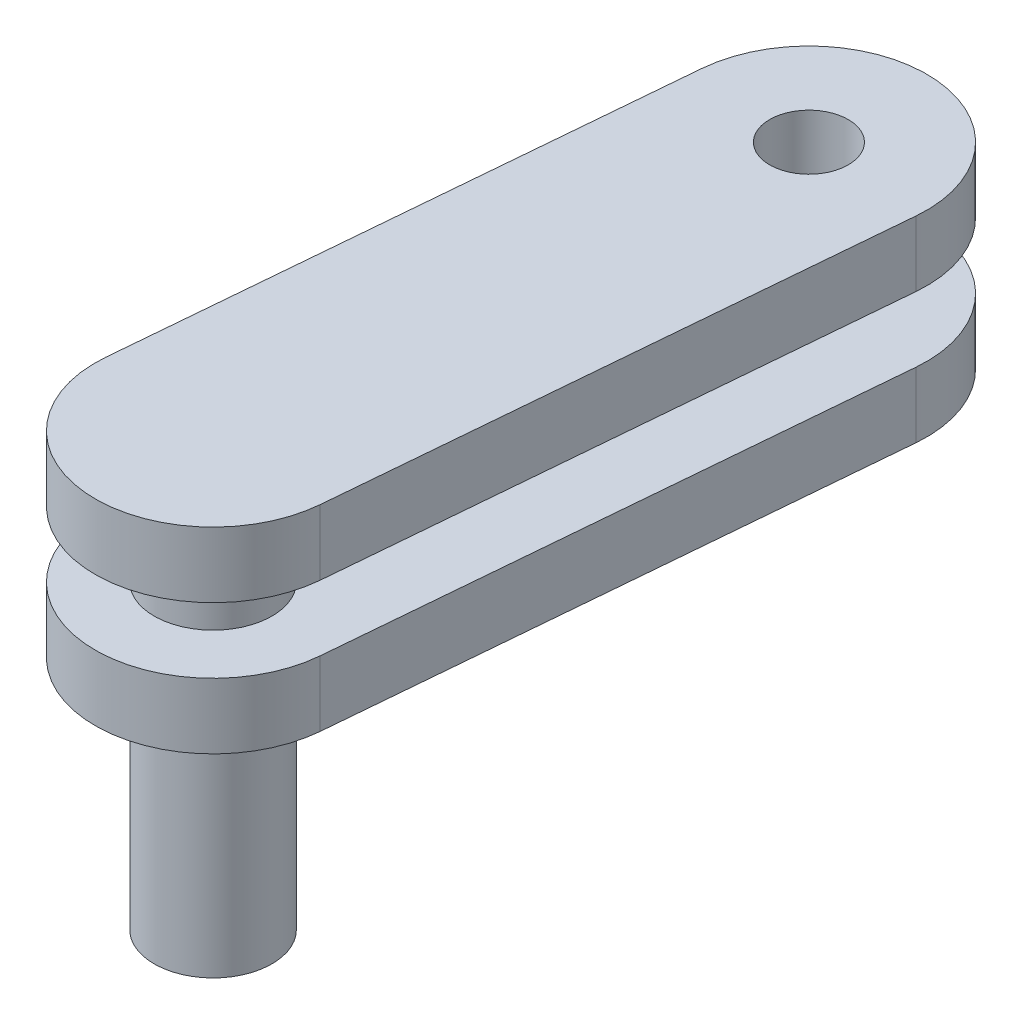
ISO-10303-21;
HEADER;
FILE_DESCRIPTION(('STEP AP214'),'2;1');
FILE_NAME('part.step','',(''),(''),'','','');
FILE_SCHEMA(('AUTOMOTIVE_DESIGN { 1 0 10303 214 1 1 1 1 }'));
ENDSEC;
DATA;
#1=APPLICATION_CONTEXT('core data for automotive mechanical design processes');
#2=APPLICATION_PROTOCOL_DEFINITION('international standard','automotive_design',2000,#1);
#3=PRODUCT_CONTEXT('',#1,'mechanical');
#4=PRODUCT('Part','Part','',(#3));
#5=PRODUCT_RELATED_PRODUCT_CATEGORY('part','',(#4));
#6=PRODUCT_DEFINITION_FORMATION('','',#4);
#7=PRODUCT_DEFINITION_CONTEXT('part definition',#1,'design');
#8=PRODUCT_DEFINITION('design','',#6,#7);
#9=PRODUCT_DEFINITION_SHAPE('','',#8);
#10=(LENGTH_UNIT() NAMED_UNIT(*) SI_UNIT(.MILLI.,.METRE.));
#11=(NAMED_UNIT(*) PLANE_ANGLE_UNIT() SI_UNIT($,.RADIAN.));
#12=(NAMED_UNIT(*) SI_UNIT($,.STERADIAN.) SOLID_ANGLE_UNIT());
#13=UNCERTAINTY_MEASURE_WITH_UNIT(LENGTH_MEASURE(1.E-05),#10,'distance_accuracy_value','');
#14=(GEOMETRIC_REPRESENTATION_CONTEXT(3) GLOBAL_UNCERTAINTY_ASSIGNED_CONTEXT((#13)) GLOBAL_UNIT_ASSIGNED_CONTEXT((#10,
#11,#12)) REPRESENTATION_CONTEXT('',''));
#15=CARTESIAN_POINT('',(0.,0.,0.));
#16=DIRECTION('',(0.,0.,1.));
#17=DIRECTION('',(1.,0.,0.));
#18=AXIS2_PLACEMENT_3D('',#15,#16,#17);
#19=CARTESIAN_POINT('',(416.335578617615,140.,-114.955578027008));
#20=DIRECTION('',(0.,1.,0.));
#21=DIRECTION('',(1.,0.,0.));
#22=AXIS2_PLACEMENT_3D('',#19,#20,#21);
#23=PLANE('',#22);
#24=CARTESIAN_POINT('',(425.486931606119,140.,-219.556021326642));
#25=DIRECTION('',(0.,-1.,0.));
#26=DIRECTION('',(1.,0.,0.));
#27=AXIS2_PLACEMENT_3D('',#24,#25,#26);
#28=CIRCLE('',#27,15.);
#29=CARTESIAN_POINT('',(410.486931606119,140.,-219.556021326642));
#30=VERTEX_POINT('',#29);
#31=EDGE_CURVE('E184',#30,#30,#28,.T.);
#32=ORIENTED_EDGE('',*,*,#31,.F.);
#33=EDGE_LOOP('',(#32));
#34=FACE_BOUND('',#33,.T.);
#35=CARTESIAN_POINT('',(407.18422562911,140.,-10.3551347273749));
#36=DIRECTION('',(0.,-1.,0.));
#37=DIRECTION('',(1.,0.,0.));
#38=AXIS2_PLACEMENT_3D('',#35,#36,#37);
#39=CIRCLE('',#38,22.5);
#40=CARTESIAN_POINT('',(384.68422562911,140.,-10.3551347273749));
#41=VERTEX_POINT('',#40);
#42=EDGE_CURVE('E165',#41,#41,#39,.T.);
#43=ORIENTED_EDGE('',*,*,#42,.F.);
#44=EDGE_LOOP('',(#43));
#45=FACE_BOUND('',#44,.T.);
#46=CARTESIAN_POINT('',(407.18422562911,140.,-10.3551347273749));
#47=DIRECTION('',(0.,1.,0.));
#48=DIRECTION('',(-0.996194698091745,0.,-0.0871557427476624));
#49=AXIS2_PLACEMENT_3D('',#46,#47,#48);
#50=CIRCLE('',#49,45.);
#51=CARTESIAN_POINT('',(362.355464214982,140.,-14.2771431510197));
#52=VERTEX_POINT('',#51);
#53=CARTESIAN_POINT('',(452.012987043239,140.,-6.4331263037301));
#54=VERTEX_POINT('',#53);
#55=EDGE_CURVE('E28',#52,#54,#50,.T.);
#56=ORIENTED_EDGE('',*,*,#55,.F.);
#57=DIRECTION('',(-0.08715574274766,0.,0.996194698091745));
#58=VECTOR('',#57,1.);
#59=CARTESIAN_POINT('',(380.658170191991,140.,-223.478029750286));
#60=LINE('',#59,#58);
#61=CARTESIAN_POINT('',(380.658170191991,140.,-223.478029750286));
#62=VERTEX_POINT('',#61);
#63=EDGE_CURVE('E186',#62,#52,#60,.T.);
#64=ORIENTED_EDGE('',*,*,#63,.F.);
#65=CARTESIAN_POINT('',(425.486931606119,140.,-219.556021326642));
#66=DIRECTION('',(0.,1.,0.));
#67=DIRECTION('',(0.996194698091745,0.,0.0871557427476594));
#68=AXIS2_PLACEMENT_3D('',#65,#66,#67);
#69=CIRCLE('',#68,45.);
#70=CARTESIAN_POINT('',(470.315693020248,140.,-215.634012902997));
#71=VERTEX_POINT('',#70);
#72=EDGE_CURVE('E155',#71,#62,#69,.T.);
#73=ORIENTED_EDGE('',*,*,#72,.F.);
#74=DIRECTION('',(0.08715574274766,0.,-0.996194698091745));
#75=VECTOR('',#74,1.);
#76=CARTESIAN_POINT('',(452.012987043239,140.,-6.43312630373037));
#77=LINE('',#76,#75);
#78=EDGE_CURVE('E140',#54,#71,#77,.T.);
#79=ORIENTED_EDGE('',*,*,#78,.F.);
#80=EDGE_LOOP('',(#56,#64,#73,#79));
#81=FACE_BOUND('',#80,.T.);
#82=ADVANCED_FACE('F17',(#34,#45,#81),#23,.F.);
#83=CARTESIAN_POINT('',(416.335578617615,165.,-114.955578027008));
#84=DIRECTION('',(0.,1.,0.));
#85=DIRECTION('',(1.,0.,0.));
#86=AXIS2_PLACEMENT_3D('',#83,#84,#85);
#87=PLANE('',#86);
#88=CARTESIAN_POINT('',(425.486931606119,165.,-219.556021326642));
#89=DIRECTION('',(0.,-1.,0.));
#90=DIRECTION('',(1.,0.,0.));
#91=AXIS2_PLACEMENT_3D('',#88,#89,#90);
#92=CIRCLE('',#91,15.);
#93=CARTESIAN_POINT('',(410.486931606119,165.,-219.556021326642));
#94=VERTEX_POINT('',#93);
#95=EDGE_CURVE('E240',#94,#94,#92,.T.);
#96=ORIENTED_EDGE('',*,*,#95,.T.);
#97=EDGE_LOOP('',(#96));
#98=FACE_BOUND('',#97,.T.);
#99=CARTESIAN_POINT('',(407.18422562911,165.,-10.3551347273749));
#100=DIRECTION('',(0.,-1.,0.));
#101=DIRECTION('',(1.,0.,0.));
#102=AXIS2_PLACEMENT_3D('',#99,#100,#101);
#103=CIRCLE('',#102,22.5);
#104=CARTESIAN_POINT('',(384.68422562911,165.,-10.3551347273749));
#105=VERTEX_POINT('',#104);
#106=EDGE_CURVE('E169',#105,#105,#103,.T.);
#107=ORIENTED_EDGE('',*,*,#106,.T.);
#108=EDGE_LOOP('',(#107));
#109=FACE_BOUND('',#108,.T.);
#110=CARTESIAN_POINT('',(407.18422562911,165.,-10.3551347273749));
#111=DIRECTION('',(0.,1.,0.));
#112=DIRECTION('',(-0.996194698091745,0.,-0.0871557427476624));
#113=AXIS2_PLACEMENT_3D('',#110,#111,#112);
#114=CIRCLE('',#113,45.);
#115=CARTESIAN_POINT('',(362.355464214982,165.,-14.2771431510197));
#116=VERTEX_POINT('',#115);
#117=CARTESIAN_POINT('',(452.012987043239,165.,-6.4331263037301));
#118=VERTEX_POINT('',#117);
#119=EDGE_CURVE('E11',#116,#118,#114,.T.);
#120=ORIENTED_EDGE('',*,*,#119,.T.);
#121=DIRECTION('',(0.08715574274766,0.,-0.996194698091745));
#122=VECTOR('',#121,1.);
#123=CARTESIAN_POINT('',(452.012987043239,165.,-6.43312630373037));
#124=LINE('',#123,#122);
#125=CARTESIAN_POINT('',(470.315693020248,165.,-215.634012902997));
#126=VERTEX_POINT('',#125);
#127=EDGE_CURVE('E134',#118,#126,#124,.T.);
#128=ORIENTED_EDGE('',*,*,#127,.T.);
#129=CARTESIAN_POINT('',(425.486931606119,165.,-219.556021326642));
#130=DIRECTION('',(0.,1.,0.));
#131=DIRECTION('',(0.996194698091745,0.,0.0871557427476594));
#132=AXIS2_PLACEMENT_3D('',#129,#130,#131);
#133=CIRCLE('',#132,45.);
#134=CARTESIAN_POINT('',(380.658170191991,165.,-223.478029750286));
#135=VERTEX_POINT('',#134);
#136=EDGE_CURVE('E116',#126,#135,#133,.T.);
#137=ORIENTED_EDGE('',*,*,#136,.T.);
#138=DIRECTION('',(-0.08715574274766,0.,0.996194698091745));
#139=VECTOR('',#138,1.);
#140=CARTESIAN_POINT('',(380.658170191991,165.,-223.478029750286));
#141=LINE('',#140,#139);
#142=EDGE_CURVE('E233',#135,#116,#141,.T.);
#143=ORIENTED_EDGE('',*,*,#142,.T.);
#144=EDGE_LOOP('',(#120,#128,#137,#143));
#145=FACE_BOUND('',#144,.T.);
#146=ADVANCED_FACE('F136',(#98,#109,#145),#87,.T.);
#147=CARTESIAN_POINT('',(407.18422562911,140.,-10.3551347273749));
#148=DIRECTION('',(0.,1.,0.));
#149=DIRECTION('',(-0.996194698091745,0.,-0.0871557427476624));
#150=AXIS2_PLACEMENT_3D('',#147,#148,#149);
#151=CYLINDRICAL_SURFACE('',#150,45.);
#152=ORIENTED_EDGE('',*,*,#55,.T.);
#153=DIRECTION('',(0.,1.,0.));
#154=VECTOR('',#153,1.);
#155=CARTESIAN_POINT('',(452.012987043239,140.,-6.4331263037301));
#156=LINE('',#155,#154);
#157=EDGE_CURVE('E21',#54,#118,#156,.T.);
#158=ORIENTED_EDGE('',*,*,#157,.T.);
#159=ORIENTED_EDGE('',*,*,#119,.F.);
#160=DIRECTION('',(0.,1.,0.));
#161=VECTOR('',#160,1.);
#162=CARTESIAN_POINT('',(362.355464214982,140.,-14.2771431510197));
#163=LINE('',#162,#161);
#164=EDGE_CURVE('E236',#52,#116,#163,.T.);
#165=ORIENTED_EDGE('',*,*,#164,.F.);
#166=EDGE_LOOP('',(#152,#158,#159,#165));
#167=FACE_BOUND('',#166,.T.);
#168=ADVANCED_FACE('F265',(#167),#151,.T.);
#169=CARTESIAN_POINT('',(452.012987043239,140.,-6.43312630373037));
#170=DIRECTION('',(0.996194698091745,0.,0.08715574274766));
#171=DIRECTION('',(0.,-1.,0.));
#172=AXIS2_PLACEMENT_3D('',#169,#170,#171);
#173=PLANE('',#172);
#174=ORIENTED_EDGE('',*,*,#78,.T.);
#175=DIRECTION('',(0.,1.,0.));
#176=VECTOR('',#175,1.);
#177=CARTESIAN_POINT('',(470.315693020248,140.,-215.634012902997));
#178=LINE('',#177,#176);
#179=EDGE_CURVE('E143',#71,#126,#178,.T.);
#180=ORIENTED_EDGE('',*,*,#179,.T.);
#181=ORIENTED_EDGE('',*,*,#127,.F.);
#182=ORIENTED_EDGE('',*,*,#157,.F.);
#183=EDGE_LOOP('',(#174,#180,#181,#182));
#184=FACE_BOUND('',#183,.T.);
#185=ADVANCED_FACE('F144',(#184),#173,.T.);
#186=CARTESIAN_POINT('',(425.486931606119,140.,-219.556021326642));
#187=DIRECTION('',(0.,1.,0.));
#188=DIRECTION('',(0.996194698091745,0.,0.0871557427476594));
#189=AXIS2_PLACEMENT_3D('',#186,#187,#188);
#190=CYLINDRICAL_SURFACE('',#189,45.);
#191=ORIENTED_EDGE('',*,*,#72,.T.);
#192=DIRECTION('',(0.,1.,0.));
#193=VECTOR('',#192,1.);
#194=CARTESIAN_POINT('',(380.658170191991,140.,-223.478029750286));
#195=LINE('',#194,#193);
#196=EDGE_CURVE('E152',#62,#135,#195,.T.);
#197=ORIENTED_EDGE('',*,*,#196,.T.);
#198=ORIENTED_EDGE('',*,*,#136,.F.);
#199=ORIENTED_EDGE('',*,*,#179,.F.);
#200=EDGE_LOOP('',(#191,#197,#198,#199));
#201=FACE_BOUND('',#200,.T.);
#202=ADVANCED_FACE('F150',(#201),#190,.T.);
#203=CARTESIAN_POINT('',(380.658170191991,140.,-223.478029750286));
#204=DIRECTION('',(-0.996194698091745,0.,-0.08715574274766));
#205=DIRECTION('',(-0.08715574274766,0.,0.996194698091745));
#206=AXIS2_PLACEMENT_3D('',#203,#204,#205);
#207=PLANE('',#206);
#208=ORIENTED_EDGE('',*,*,#63,.T.);
#209=ORIENTED_EDGE('',*,*,#164,.T.);
#210=ORIENTED_EDGE('',*,*,#142,.F.);
#211=ORIENTED_EDGE('',*,*,#196,.F.);
#212=EDGE_LOOP('',(#208,#209,#210,#211));
#213=FACE_BOUND('',#212,.T.);
#214=ADVANCED_FACE('F263',(#213),#207,.T.);
#215=CARTESIAN_POINT('',(425.486931606119,140.,-219.556021326642));
#216=DIRECTION('',(0.,1.,0.));
#217=DIRECTION('',(1.,0.,0.));
#218=AXIS2_PLACEMENT_3D('',#215,#216,#217);
#219=CYLINDRICAL_SURFACE('',#218,15.);
#220=ORIENTED_EDGE('',*,*,#95,.F.);
#221=DIRECTION('',(0.,-1.,0.));
#222=VECTOR('',#221,1.);
#223=CARTESIAN_POINT('',(410.486931606119,140.,-219.556021326642));
#224=LINE('',#223,#222);
#225=EDGE_CURVE('E187',#94,#30,#224,.T.);
#226=ORIENTED_EDGE('',*,*,#225,.T.);
#227=ORIENTED_EDGE('',*,*,#31,.T.);
#228=ORIENTED_EDGE('',*,*,#225,.F.);
#229=EDGE_LOOP('',(#220,#226,#227,#228));
#230=FACE_BOUND('',#229,.T.);
#231=ADVANCED_FACE('F312',(#230),#219,.F.);
#232=CARTESIAN_POINT('',(416.335578617615,190.,-114.955578027008));
#233=DIRECTION('',(0.,1.,0.));
#234=DIRECTION('',(1.,0.,0.));
#235=AXIS2_PLACEMENT_3D('',#232,#233,#234);
#236=PLANE('',#235);
#237=CARTESIAN_POINT('',(425.486931606119,190.,-219.556021326642));
#238=DIRECTION('',(0.,-1.,0.));
#239=DIRECTION('',(1.,0.,0.));
#240=AXIS2_PLACEMENT_3D('',#237,#238,#239);
#241=CIRCLE('',#240,15.);
#242=CARTESIAN_POINT('',(410.486931606119,190.,-219.556021326642));
#243=VERTEX_POINT('',#242);
#244=EDGE_CURVE('E196',#243,#243,#241,.T.);
#245=ORIENTED_EDGE('',*,*,#244,.F.);
#246=EDGE_LOOP('',(#245));
#247=FACE_BOUND('',#246,.T.);
#248=CARTESIAN_POINT('',(407.18422562911,190.,-10.3551347273749));
#249=DIRECTION('',(0.,-1.,0.));
#250=DIRECTION('',(1.,0.,0.));
#251=AXIS2_PLACEMENT_3D('',#248,#249,#250);
#252=CIRCLE('',#251,22.5);
#253=CARTESIAN_POINT('',(384.68422562911,190.,-10.3551347273749));
#254=VERTEX_POINT('',#253);
#255=EDGE_CURVE('E208',#254,#254,#252,.T.);
#256=ORIENTED_EDGE('',*,*,#255,.F.);
#257=EDGE_LOOP('',(#256));
#258=FACE_BOUND('',#257,.T.);
#259=CARTESIAN_POINT('',(407.18422562911,190.,-10.3551347273749));
#260=DIRECTION('',(0.,1.,0.));
#261=DIRECTION('',(-0.996194698091745,0.,-0.0871557427476624));
#262=AXIS2_PLACEMENT_3D('',#259,#260,#261);
#263=CIRCLE('',#262,45.);
#264=CARTESIAN_POINT('',(362.355464214982,190.,-14.2771431510197));
#265=VERTEX_POINT('',#264);
#266=CARTESIAN_POINT('',(452.012987043239,190.,-6.4331263037301));
#267=VERTEX_POINT('',#266);
#268=EDGE_CURVE('E65',#265,#267,#263,.T.);
#269=ORIENTED_EDGE('',*,*,#268,.F.);
#270=DIRECTION('',(-0.08715574274766,0.,0.996194698091745));
#271=VECTOR('',#270,1.);
#272=CARTESIAN_POINT('',(380.658170191991,190.,-223.478029750286));
#273=LINE('',#272,#271);
#274=CARTESIAN_POINT('',(380.658170191991,190.,-223.478029750286));
#275=VERTEX_POINT('',#274);
#276=EDGE_CURVE('E191',#275,#265,#273,.T.);
#277=ORIENTED_EDGE('',*,*,#276,.F.);
#278=CARTESIAN_POINT('',(425.486931606119,190.,-219.556021326642));
#279=DIRECTION('',(0.,1.,0.));
#280=DIRECTION('',(0.996194698091745,0.,0.0871557427476594));
#281=AXIS2_PLACEMENT_3D('',#278,#279,#280);
#282=CIRCLE('',#281,45.);
#283=CARTESIAN_POINT('',(470.315693020248,190.,-215.634012902997));
#284=VERTEX_POINT('',#283);
#285=EDGE_CURVE('E258',#284,#275,#282,.T.);
#286=ORIENTED_EDGE('',*,*,#285,.F.);
#287=DIRECTION('',(0.08715574274766,0.,-0.996194698091745));
#288=VECTOR('',#287,1.);
#289=CARTESIAN_POINT('',(452.012987043239,190.,-6.43312630373037));
#290=LINE('',#289,#288);
#291=EDGE_CURVE('E173',#267,#284,#290,.T.);
#292=ORIENTED_EDGE('',*,*,#291,.F.);
#293=EDGE_LOOP('',(#269,#277,#286,#292));
#294=FACE_BOUND('',#293,.T.);
#295=ADVANCED_FACE('F308',(#247,#258,#294),#236,.F.);
#296=CARTESIAN_POINT('',(416.335578617615,215.,-114.955578027008));
#297=DIRECTION('',(0.,1.,0.));
#298=DIRECTION('',(1.,0.,0.));
#299=AXIS2_PLACEMENT_3D('',#296,#297,#298);
#300=PLANE('',#299);
#301=CARTESIAN_POINT('',(425.486931606119,215.,-219.556021326642));
#302=DIRECTION('',(0.,-1.,0.));
#303=DIRECTION('',(1.,0.,0.));
#304=AXIS2_PLACEMENT_3D('',#301,#302,#303);
#305=CIRCLE('',#304,15.);
#306=CARTESIAN_POINT('',(410.486931606119,215.,-219.556021326642));
#307=VERTEX_POINT('',#306);
#308=EDGE_CURVE('E179',#307,#307,#305,.T.);
#309=ORIENTED_EDGE('',*,*,#308,.T.);
#310=EDGE_LOOP('',(#309));
#311=FACE_BOUND('',#310,.T.);
#312=CARTESIAN_POINT('',(407.18422562911,215.,-10.3551347273749));
#313=DIRECTION('',(0.,1.,0.));
#314=DIRECTION('',(-0.996194698091745,0.,-0.0871557427476624));
#315=AXIS2_PLACEMENT_3D('',#312,#313,#314);
#316=CIRCLE('',#315,45.);
#317=CARTESIAN_POINT('',(362.355464214982,215.,-14.2771431510197));
#318=VERTEX_POINT('',#317);
#319=CARTESIAN_POINT('',(452.012987043239,215.,-6.4331263037301));
#320=VERTEX_POINT('',#319);
#321=EDGE_CURVE('E199',#318,#320,#316,.T.);
#322=ORIENTED_EDGE('',*,*,#321,.T.);
#323=DIRECTION('',(0.08715574274766,0.,-0.996194698091745));
#324=VECTOR('',#323,1.);
#325=CARTESIAN_POINT('',(452.012987043239,215.,-6.43312630373037));
#326=LINE('',#325,#324);
#327=CARTESIAN_POINT('',(470.315693020248,215.,-215.634012902997));
#328=VERTEX_POINT('',#327);
#329=EDGE_CURVE('E80',#320,#328,#326,.T.);
#330=ORIENTED_EDGE('',*,*,#329,.T.);
#331=CARTESIAN_POINT('',(425.486931606119,215.,-219.556021326642));
#332=DIRECTION('',(0.,1.,0.));
#333=DIRECTION('',(0.996194698091745,0.,0.0871557427476594));
#334=AXIS2_PLACEMENT_3D('',#331,#332,#333);
#335=CIRCLE('',#334,45.);
#336=CARTESIAN_POINT('',(380.658170191991,215.,-223.478029750286));
#337=VERTEX_POINT('',#336);
#338=EDGE_CURVE('E174',#328,#337,#335,.T.);
#339=ORIENTED_EDGE('',*,*,#338,.T.);
#340=DIRECTION('',(-0.08715574274766,0.,0.996194698091745));
#341=VECTOR('',#340,1.);
#342=CARTESIAN_POINT('',(380.658170191991,215.,-223.478029750286));
#343=LINE('',#342,#341);
#344=EDGE_CURVE('E215',#337,#318,#343,.T.);
#345=ORIENTED_EDGE('',*,*,#344,.T.);
#346=EDGE_LOOP('',(#322,#330,#339,#345));
#347=FACE_BOUND('',#346,.T.);
#348=ADVANCED_FACE('F311',(#311,#347),#300,.T.);
#349=CARTESIAN_POINT('',(407.18422562911,190.,-10.3551347273749));
#350=DIRECTION('',(0.,1.,0.));
#351=DIRECTION('',(-0.996194698091745,0.,-0.0871557427476624));
#352=AXIS2_PLACEMENT_3D('',#349,#350,#351);
#353=CYLINDRICAL_SURFACE('',#352,45.);
#354=ORIENTED_EDGE('',*,*,#268,.T.);
#355=DIRECTION('',(0.,1.,0.));
#356=VECTOR('',#355,1.);
#357=CARTESIAN_POINT('',(452.012987043239,190.,-6.4331263037301));
#358=LINE('',#357,#356);
#359=EDGE_CURVE('E200',#267,#320,#358,.T.);
#360=ORIENTED_EDGE('',*,*,#359,.T.);
#361=ORIENTED_EDGE('',*,*,#321,.F.);
#362=DIRECTION('',(0.,1.,0.));
#363=VECTOR('',#362,1.);
#364=CARTESIAN_POINT('',(362.355464214982,190.,-14.2771431510197));
#365=LINE('',#364,#363);
#366=EDGE_CURVE('E195',#265,#318,#365,.T.);
#367=ORIENTED_EDGE('',*,*,#366,.F.);
#368=EDGE_LOOP('',(#354,#360,#361,#367));
#369=FACE_BOUND('',#368,.T.);
#370=ADVANCED_FACE('F320',(#369),#353,.T.);
#371=CARTESIAN_POINT('',(452.012987043239,190.,-6.43312630373037));
#372=DIRECTION('',(0.996194698091745,0.,0.08715574274766));
#373=DIRECTION('',(0.,-1.,0.));
#374=AXIS2_PLACEMENT_3D('',#371,#372,#373);
#375=PLANE('',#374);
#376=ORIENTED_EDGE('',*,*,#291,.T.);
#377=DIRECTION('',(0.,1.,0.));
#378=VECTOR('',#377,1.);
#379=CARTESIAN_POINT('',(470.315693020248,190.,-215.634012902997));
#380=LINE('',#379,#378);
#381=EDGE_CURVE('E170',#284,#328,#380,.T.);
#382=ORIENTED_EDGE('',*,*,#381,.T.);
#383=ORIENTED_EDGE('',*,*,#329,.F.);
#384=ORIENTED_EDGE('',*,*,#359,.F.);
#385=EDGE_LOOP('',(#376,#382,#383,#384));
#386=FACE_BOUND('',#385,.T.);
#387=ADVANCED_FACE('F19',(#386),#375,.T.);
#388=CARTESIAN_POINT('',(425.486931606119,190.,-219.556021326642));
#389=DIRECTION('',(0.,1.,0.));
#390=DIRECTION('',(0.996194698091745,0.,0.0871557427476594));
#391=AXIS2_PLACEMENT_3D('',#388,#389,#390);
#392=CYLINDRICAL_SURFACE('',#391,45.);
#393=ORIENTED_EDGE('',*,*,#285,.T.);
#394=DIRECTION('',(0.,1.,0.));
#395=VECTOR('',#394,1.);
#396=CARTESIAN_POINT('',(380.658170191991,190.,-223.478029750286));
#397=LINE('',#396,#395);
#398=EDGE_CURVE('E250',#275,#337,#397,.T.);
#399=ORIENTED_EDGE('',*,*,#398,.T.);
#400=ORIENTED_EDGE('',*,*,#338,.F.);
#401=ORIENTED_EDGE('',*,*,#381,.F.);
#402=EDGE_LOOP('',(#393,#399,#400,#401));
#403=FACE_BOUND('',#402,.T.);
#404=ADVANCED_FACE('F290',(#403),#392,.T.);
#405=CARTESIAN_POINT('',(380.658170191991,190.,-223.478029750286));
#406=DIRECTION('',(-0.996194698091745,0.,-0.08715574274766));
#407=DIRECTION('',(-0.08715574274766,0.,0.996194698091745));
#408=AXIS2_PLACEMENT_3D('',#405,#406,#407);
#409=PLANE('',#408);
#410=ORIENTED_EDGE('',*,*,#276,.T.);
#411=ORIENTED_EDGE('',*,*,#366,.T.);
#412=ORIENTED_EDGE('',*,*,#344,.F.);
#413=ORIENTED_EDGE('',*,*,#398,.F.);
#414=EDGE_LOOP('',(#410,#411,#412,#413));
#415=FACE_BOUND('',#414,.T.);
#416=ADVANCED_FACE('F288',(#415),#409,.T.);
#417=CARTESIAN_POINT('',(425.486931606119,190.,-219.556021326642));
#418=DIRECTION('',(0.,1.,0.));
#419=DIRECTION('',(1.,0.,0.));
#420=AXIS2_PLACEMENT_3D('',#417,#418,#419);
#421=CYLINDRICAL_SURFACE('',#420,15.);
#422=ORIENTED_EDGE('',*,*,#308,.F.);
#423=DIRECTION('',(0.,-1.,0.));
#424=VECTOR('',#423,1.);
#425=CARTESIAN_POINT('',(410.486931606119,190.,-219.556021326642));
#426=LINE('',#425,#424);
#427=EDGE_CURVE('E183',#307,#243,#426,.T.);
#428=ORIENTED_EDGE('',*,*,#427,.T.);
#429=ORIENTED_EDGE('',*,*,#244,.T.);
#430=ORIENTED_EDGE('',*,*,#427,.F.);
#431=EDGE_LOOP('',(#422,#428,#429,#430));
#432=FACE_BOUND('',#431,.T.);
#433=ADVANCED_FACE('F284',(#432),#421,.F.);
#434=CARTESIAN_POINT('',(407.18422562911,50.,-10.3551347273749));
#435=DIRECTION('',(0.,-1.,0.));
#436=DIRECTION('',(0.,0.,-1.));
#437=AXIS2_PLACEMENT_3D('',#434,#435,#436);
#438=PLANE('',#437);
#439=CARTESIAN_POINT('',(407.18422562911,50.,-10.3551347273749));
#440=DIRECTION('',(0.,1.,0.));
#441=DIRECTION('',(1.,0.,0.));
#442=AXIS2_PLACEMENT_3D('',#439,#440,#441);
#443=CIRCLE('',#442,22.5);
#444=CARTESIAN_POINT('',(384.68422562911,50.,-10.3551347273749));
#445=VERTEX_POINT('',#444);
#446=EDGE_CURVE('E178',#445,#445,#443,.T.);
#447=ORIENTED_EDGE('',*,*,#446,.F.);
#448=EDGE_LOOP('',(#447));
#449=FACE_BOUND('',#448,.T.);
#450=ADVANCED_FACE('F287',(#449),#438,.T.);
#451=CARTESIAN_POINT('',(407.18422562911,50.,-10.3551347273749));
#452=DIRECTION('',(0.,1.,0.));
#453=DIRECTION('',(1.,0.,0.));
#454=AXIS2_PLACEMENT_3D('',#451,#452,#453);
#455=CYLINDRICAL_SURFACE('',#454,22.5);
#456=ORIENTED_EDGE('',*,*,#42,.T.);
#457=DIRECTION('',(0.,-1.,0.));
#458=VECTOR('',#457,1.);
#459=CARTESIAN_POINT('',(384.68422562911,50.,-10.3551347273749));
#460=LINE('',#459,#458);
#461=EDGE_CURVE('E168',#41,#445,#460,.T.);
#462=ORIENTED_EDGE('',*,*,#461,.T.);
#463=ORIENTED_EDGE('',*,*,#446,.T.);
#464=ORIENTED_EDGE('',*,*,#461,.F.);
#465=EDGE_LOOP('',(#456,#462,#463,#464));
#466=FACE_BOUND('',#465,.T.);
#467=ADVANCED_FACE('F295',(#466),#455,.T.);
#468=CARTESIAN_POINT('',(407.18422562911,50.,-10.3551347273749));
#469=DIRECTION('',(0.,1.,0.));
#470=DIRECTION('',(1.,0.,0.));
#471=AXIS2_PLACEMENT_3D('',#468,#469,#470);
#472=CYLINDRICAL_SURFACE('',#471,22.5);
#473=ORIENTED_EDGE('',*,*,#255,.T.);
#474=DIRECTION('',(0.,-1.,0.));
#475=VECTOR('',#474,1.);
#476=CARTESIAN_POINT('',(384.68422562911,50.,-10.3551347273749));
#477=LINE('',#476,#475);
#478=EDGE_CURVE('E204',#254,#105,#477,.T.);
#479=ORIENTED_EDGE('',*,*,#478,.T.);
#480=ORIENTED_EDGE('',*,*,#106,.F.);
#481=ORIENTED_EDGE('',*,*,#478,.F.);
#482=EDGE_LOOP('',(#473,#479,#480,#481));
#483=FACE_BOUND('',#482,.T.);
#484=ADVANCED_FACE('F293',(#483),#472,.T.);
#485=CLOSED_SHELL('',(#82,#146,#168,#185,#202,#214,#231,#295,#348,#370,#387,#404,#416,#433,#450,
#467,#484));
#486=MANIFOLD_SOLID_BREP('B1',#485);
#487=ADVANCED_BREP_SHAPE_REPRESENTATION('',(#18,#486),#14);
#488=SHAPE_DEFINITION_REPRESENTATION(#9,#487);
ENDSEC;
END-ISO-10303-21;
